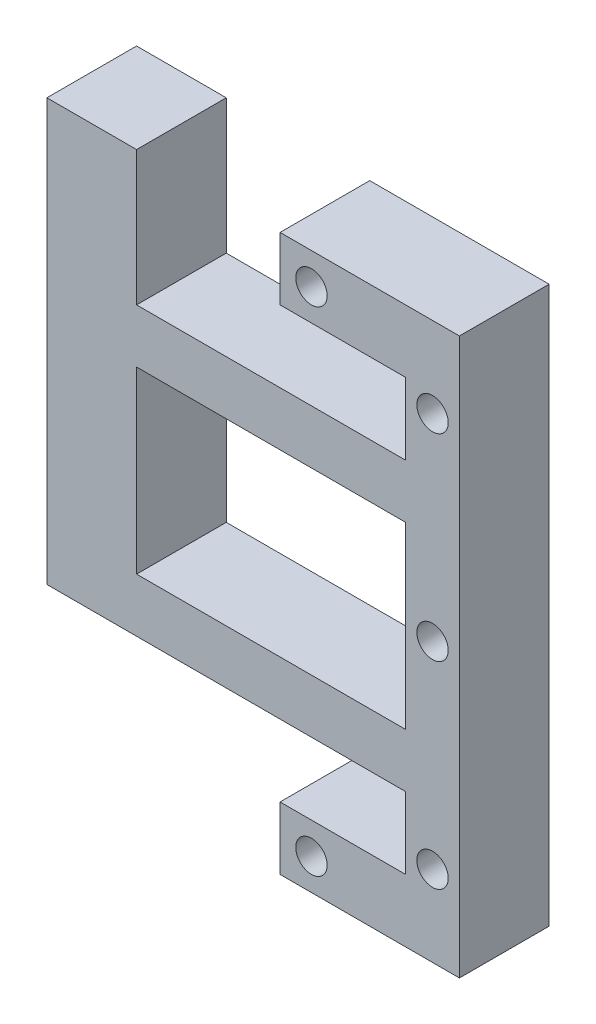
ISO-10303-21;
HEADER;
FILE_DESCRIPTION(('STEP AP214'),'2;1');
FILE_NAME('part.step','',(''),(''),'','','');
FILE_SCHEMA(('AUTOMOTIVE_DESIGN { 1 0 10303 214 1 1 1 1 }'));
ENDSEC;
DATA;
#1=APPLICATION_CONTEXT('core data for automotive mechanical design processes');
#2=APPLICATION_PROTOCOL_DEFINITION('international standard','automotive_design',2000,#1);
#3=PRODUCT_CONTEXT('',#1,'mechanical');
#4=PRODUCT('Part','Part','',(#3));
#5=PRODUCT_RELATED_PRODUCT_CATEGORY('part','',(#4));
#6=PRODUCT_DEFINITION_FORMATION('','',#4);
#7=PRODUCT_DEFINITION_CONTEXT('part definition',#1,'design');
#8=PRODUCT_DEFINITION('design','',#6,#7);
#9=PRODUCT_DEFINITION_SHAPE('','',#8);
#10=(LENGTH_UNIT() NAMED_UNIT(*) SI_UNIT(.MILLI.,.METRE.));
#11=(NAMED_UNIT(*) PLANE_ANGLE_UNIT() SI_UNIT($,.RADIAN.));
#12=(NAMED_UNIT(*) SI_UNIT($,.STERADIAN.) SOLID_ANGLE_UNIT());
#13=UNCERTAINTY_MEASURE_WITH_UNIT(LENGTH_MEASURE(1.E-05),#10,'distance_accuracy_value','');
#14=(GEOMETRIC_REPRESENTATION_CONTEXT(3) GLOBAL_UNCERTAINTY_ASSIGNED_CONTEXT((#13)) GLOBAL_UNIT_ASSIGNED_CONTEXT((#10,
#11,#12)) REPRESENTATION_CONTEXT('',''));
#15=CARTESIAN_POINT('',(0.,0.,0.));
#16=DIRECTION('',(0.,0.,1.));
#17=DIRECTION('',(1.,0.,0.));
#18=AXIS2_PLACEMENT_3D('',#15,#16,#17);
#19=CARTESIAN_POINT('',(5.,56.,10.));
#20=DIRECTION('',(1.,0.,0.));
#21=DIRECTION('',(0.,1.,0.));
#22=AXIS2_PLACEMENT_3D('',#19,#20,#21);
#23=PLANE('',#22);
#24=DIRECTION('',(0.,0.,1.));
#25=VECTOR('',#24,1.);
#26=CARTESIAN_POINT('',(5.,16.,-48.0520551069359));
#27=LINE('',#26,#25);
#28=CARTESIAN_POINT('',(5.,16.,0.));
#29=VERTEX_POINT('',#28);
#30=CARTESIAN_POINT('',(5.,16.,10.));
#31=VERTEX_POINT('',#30);
#32=EDGE_CURVE('E217',#29,#31,#27,.T.);
#33=ORIENTED_EDGE('',*,*,#32,.F.);
#34=DIRECTION('',(0.,-1.,0.));
#35=VECTOR('',#34,1.);
#36=CARTESIAN_POINT('',(5.,56.,0.));
#37=LINE('',#36,#35);
#38=CARTESIAN_POINT('',(5.,8.,0.));
#39=VERTEX_POINT('',#38);
#40=EDGE_CURVE('E230',#29,#39,#37,.T.);
#41=ORIENTED_EDGE('',*,*,#40,.T.);
#42=DIRECTION('',(0.,0.,-1.));
#43=VECTOR('',#42,1.);
#44=CARTESIAN_POINT('',(5.,8.,10.));
#45=LINE('',#44,#43);
#46=CARTESIAN_POINT('',(5.,8.,10.));
#47=VERTEX_POINT('',#46);
#48=EDGE_CURVE('E98',#47,#39,#45,.T.);
#49=ORIENTED_EDGE('',*,*,#48,.F.);
#50=DIRECTION('',(0.,-1.,0.));
#51=VECTOR('',#50,1.);
#52=CARTESIAN_POINT('',(5.,56.,10.));
#53=LINE('',#52,#51);
#54=EDGE_CURVE('E232',#31,#47,#53,.T.);
#55=ORIENTED_EDGE('',*,*,#54,.F.);
#56=EDGE_LOOP('',(#33,#41,#49,#55));
#57=FACE_BOUND('',#56,.T.);
#58=ADVANCED_FACE('F89',(#57),#23,.F.);
#59=CARTESIAN_POINT('',(5.,42.,0.));
#60=VERTEX_POINT('',#59);
#61=CARTESIAN_POINT('',(5.,22.,0.));
#62=VERTEX_POINT('',#61);
#63=EDGE_CURVE('E242',#60,#62,#37,.T.);
#64=ORIENTED_EDGE('',*,*,#63,.T.);
#65=DIRECTION('',(0.,0.,1.));
#66=VECTOR('',#65,1.);
#67=CARTESIAN_POINT('',(5.,22.,-48.0520551069359));
#68=LINE('',#67,#66);
#69=CARTESIAN_POINT('',(5.,22.,10.));
#70=VERTEX_POINT('',#69);
#71=EDGE_CURVE('E234',#62,#70,#68,.T.);
#72=ORIENTED_EDGE('',*,*,#71,.T.);
#73=CARTESIAN_POINT('',(5.,42.,10.));
#74=VERTEX_POINT('',#73);
#75=EDGE_CURVE('E313',#74,#70,#53,.T.);
#76=ORIENTED_EDGE('',*,*,#75,.F.);
#77=DIRECTION('',(0.,0.,1.));
#78=VECTOR('',#77,1.);
#79=CARTESIAN_POINT('',(5.,42.,-48.0520551069359));
#80=LINE('',#79,#78);
#81=EDGE_CURVE('E390',#60,#74,#80,.T.);
#82=ORIENTED_EDGE('',*,*,#81,.F.);
#83=EDGE_LOOP('',(#64,#72,#76,#82));
#84=FACE_BOUND('',#83,.T.);
#85=ADVANCED_FACE('F464',(#84),#23,.F.);
#86=CARTESIAN_POINT('',(0.,0.,10.));
#87=DIRECTION('',(0.,0.,-1.));
#88=DIRECTION('',(-1.,0.,0.));
#89=AXIS2_PLACEMENT_3D('',#86,#87,#88);
#90=PLANE('',#89);
#91=DIRECTION('',(-1.,0.,0.));
#92=VECTOR('',#91,1.);
#93=CARTESIAN_POINT('',(5.,42.,10.));
#94=LINE('',#93,#92);
#95=CARTESIAN_POINT('',(-25.,42.,10.));
#96=VERTEX_POINT('',#95);
#97=EDGE_CURVE('E394',#74,#96,#94,.T.);
#98=ORIENTED_EDGE('',*,*,#97,.F.);
#99=ORIENTED_EDGE('',*,*,#75,.T.);
#100=DIRECTION('',(-1.,0.,0.));
#101=VECTOR('',#100,1.);
#102=CARTESIAN_POINT('',(0.,22.,10.));
#103=LINE('',#102,#101);
#104=CARTESIAN_POINT('',(-25.,22.,10.));
#105=VERTEX_POINT('',#104);
#106=EDGE_CURVE('E226',#70,#105,#103,.T.);
#107=ORIENTED_EDGE('',*,*,#106,.T.);
#108=DIRECTION('',(0.,1.,0.));
#109=VECTOR('',#108,1.);
#110=CARTESIAN_POINT('',(-25.,16.,10.));
#111=LINE('',#110,#109);
#112=EDGE_CURVE('E428',#105,#96,#111,.T.);
#113=ORIENTED_EDGE('',*,*,#112,.T.);
#114=EDGE_LOOP('',(#98,#99,#107,#113));
#115=FACE_BOUND('',#114,.T.);
#116=DIRECTION('',(1.,0.,0.));
#117=VECTOR('',#116,1.);
#118=CARTESIAN_POINT('',(-9.,56.,10.));
#119=LINE('',#118,#117);
#120=CARTESIAN_POINT('',(-9.,56.,10.));
#121=VERTEX_POINT('',#120);
#122=CARTESIAN_POINT('',(5.,56.,10.));
#123=VERTEX_POINT('',#122);
#124=EDGE_CURVE('E276',#121,#123,#119,.T.);
#125=ORIENTED_EDGE('',*,*,#124,.T.);
#126=CARTESIAN_POINT('',(5.,48.,10.));
#127=VERTEX_POINT('',#126);
#128=EDGE_CURVE('E307',#123,#127,#53,.T.);
#129=ORIENTED_EDGE('',*,*,#128,.T.);
#130=DIRECTION('',(-1.,0.,0.));
#131=VECTOR('',#130,1.);
#132=CARTESIAN_POINT('',(5.,48.,10.));
#133=LINE('',#132,#131);
#134=CARTESIAN_POINT('',(-25.,48.,10.));
#135=VERTEX_POINT('',#134);
#136=EDGE_CURVE('E397',#127,#135,#133,.T.);
#137=ORIENTED_EDGE('',*,*,#136,.T.);
#138=CARTESIAN_POINT('',(-25.,63.,10.));
#139=VERTEX_POINT('',#138);
#140=EDGE_CURVE('E440',#135,#139,#111,.T.);
#141=ORIENTED_EDGE('',*,*,#140,.T.);
#142=DIRECTION('',(1.,0.,0.));
#143=VECTOR('',#142,1.);
#144=CARTESIAN_POINT('',(-35.,63.,10.));
#145=LINE('',#144,#143);
#146=CARTESIAN_POINT('',(-35.,63.,10.));
#147=VERTEX_POINT('',#146);
#148=EDGE_CURVE('E416',#147,#139,#145,.T.);
#149=ORIENTED_EDGE('',*,*,#148,.F.);
#150=DIRECTION('',(0.,1.,0.));
#151=VECTOR('',#150,1.);
#152=CARTESIAN_POINT('',(-35.,16.,10.));
#153=LINE('',#152,#151);
#154=CARTESIAN_POINT('',(-35.,16.,10.));
#155=VERTEX_POINT('',#154);
#156=EDGE_CURVE('E419',#155,#147,#153,.T.);
#157=ORIENTED_EDGE('',*,*,#156,.F.);
#158=DIRECTION('',(-1.,0.,0.));
#159=VECTOR('',#158,1.);
#160=CARTESIAN_POINT('',(0.,16.,10.));
#161=LINE('',#160,#159);
#162=EDGE_CURVE('E105',#31,#155,#161,.T.);
#163=ORIENTED_EDGE('',*,*,#162,.F.);
#164=ORIENTED_EDGE('',*,*,#54,.T.);
#165=DIRECTION('',(-1.,0.,0.));
#166=VECTOR('',#165,1.);
#167=CARTESIAN_POINT('',(5.,8.,10.));
#168=LINE('',#167,#166);
#169=CARTESIAN_POINT('',(-8.99999999999999,8.,10.));
#170=VERTEX_POINT('',#169);
#171=EDGE_CURVE('E303',#47,#170,#168,.T.);
#172=ORIENTED_EDGE('',*,*,#171,.T.);
#173=DIRECTION('',(0.,-1.,0.));
#174=VECTOR('',#173,1.);
#175=CARTESIAN_POINT('',(-8.99999999999999,8.,10.));
#176=LINE('',#175,#174);
#177=CARTESIAN_POINT('',(-8.99999999999999,1.00000000000001,10.));
#178=VERTEX_POINT('',#177);
#179=EDGE_CURVE('E306',#170,#178,#176,.T.);
#180=ORIENTED_EDGE('',*,*,#179,.T.);
#181=DIRECTION('',(1.,0.,0.));
#182=VECTOR('',#181,1.);
#183=CARTESIAN_POINT('',(-8.99999999999999,1.00000000000001,10.));
#184=LINE('',#183,#182);
#185=CARTESIAN_POINT('',(11.,1.00000000000001,10.));
#186=VERTEX_POINT('',#185);
#187=EDGE_CURVE('E311',#178,#186,#184,.T.);
#188=ORIENTED_EDGE('',*,*,#187,.T.);
#189=DIRECTION('',(0.,1.,0.));
#190=VECTOR('',#189,1.);
#191=CARTESIAN_POINT('',(11.,1.00000000000001,10.));
#192=LINE('',#191,#190);
#193=CARTESIAN_POINT('',(11.,63.,10.));
#194=VERTEX_POINT('',#193);
#195=EDGE_CURVE('E319',#186,#194,#192,.T.);
#196=ORIENTED_EDGE('',*,*,#195,.T.);
#197=DIRECTION('',(-1.,0.,0.));
#198=VECTOR('',#197,1.);
#199=CARTESIAN_POINT('',(11.,63.,10.));
#200=LINE('',#199,#198);
#201=CARTESIAN_POINT('',(-9.,63.,10.));
#202=VERTEX_POINT('',#201);
#203=EDGE_CURVE('E322',#194,#202,#200,.T.);
#204=ORIENTED_EDGE('',*,*,#203,.T.);
#205=DIRECTION('',(0.,-1.,0.));
#206=VECTOR('',#205,1.);
#207=CARTESIAN_POINT('',(-9.,63.,10.));
#208=LINE('',#207,#206);
#209=EDGE_CURVE('E282',#202,#121,#208,.T.);
#210=ORIENTED_EDGE('',*,*,#209,.T.);
#211=EDGE_LOOP('',(#125,#129,#137,#141,#149,#157,#163,#164,#172,#180,#188,#196,#204,#210));
#212=FACE_BOUND('',#211,.T.);
#213=CARTESIAN_POINT('',(-5.5,59.5,10.));
#214=DIRECTION('',(0.,0.,1.));
#215=DIRECTION('',(1.,0.,0.));
#216=AXIS2_PLACEMENT_3D('',#213,#214,#215);
#217=CIRCLE('',#216,1.75);
#218=CARTESIAN_POINT('',(-3.75,59.5,10.));
#219=VERTEX_POINT('',#218);
#220=EDGE_CURVE('E250',#219,#219,#217,.T.);
#221=ORIENTED_EDGE('',*,*,#220,.F.);
#222=EDGE_LOOP('',(#221));
#223=FACE_BOUND('',#222,.T.);
#224=CARTESIAN_POINT('',(8.,54.,10.));
#225=DIRECTION('',(0.,0.,1.));
#226=DIRECTION('',(1.,0.,0.));
#227=AXIS2_PLACEMENT_3D('',#224,#225,#226);
#228=CIRCLE('',#227,1.75);
#229=CARTESIAN_POINT('',(9.75,54.,10.));
#230=VERTEX_POINT('',#229);
#231=EDGE_CURVE('E347',#230,#230,#228,.T.);
#232=ORIENTED_EDGE('',*,*,#231,.F.);
#233=EDGE_LOOP('',(#232));
#234=FACE_BOUND('',#233,.T.);
#235=CARTESIAN_POINT('',(-5.49999999999999,4.5,10.));
#236=DIRECTION('',(0.,0.,1.));
#237=DIRECTION('',(1.,0.,0.));
#238=AXIS2_PLACEMENT_3D('',#235,#236,#237);
#239=CIRCLE('',#238,1.75);
#240=CARTESIAN_POINT('',(-3.74999999999999,4.5,10.));
#241=VERTEX_POINT('',#240);
#242=EDGE_CURVE('E355',#241,#241,#239,.T.);
#243=ORIENTED_EDGE('',*,*,#242,.F.);
#244=EDGE_LOOP('',(#243));
#245=FACE_BOUND('',#244,.T.);
#246=CARTESIAN_POINT('',(8.,10.,10.));
#247=DIRECTION('',(0.,0.,1.));
#248=DIRECTION('',(1.,0.,0.));
#249=AXIS2_PLACEMENT_3D('',#246,#247,#248);
#250=CIRCLE('',#249,1.75);
#251=CARTESIAN_POINT('',(9.75,10.,10.));
#252=VERTEX_POINT('',#251);
#253=EDGE_CURVE('E363',#252,#252,#250,.T.);
#254=ORIENTED_EDGE('',*,*,#253,.F.);
#255=EDGE_LOOP('',(#254));
#256=FACE_BOUND('',#255,.T.);
#257=CARTESIAN_POINT('',(8.,32.,10.));
#258=DIRECTION('',(0.,0.,1.));
#259=DIRECTION('',(1.,0.,0.));
#260=AXIS2_PLACEMENT_3D('',#257,#258,#259);
#261=CIRCLE('',#260,1.75);
#262=CARTESIAN_POINT('',(9.75,32.,10.));
#263=VERTEX_POINT('',#262);
#264=EDGE_CURVE('E371',#263,#263,#261,.T.);
#265=ORIENTED_EDGE('',*,*,#264,.F.);
#266=EDGE_LOOP('',(#265));
#267=FACE_BOUND('',#266,.T.);
#268=ADVANCED_FACE('F329',(#115,#212,#223,#234,#245,#256,#267),#90,.F.);
#269=CARTESIAN_POINT('',(0.,0.,0.));
#270=DIRECTION('',(0.,0.,-1.));
#271=DIRECTION('',(-1.,0.,0.));
#272=AXIS2_PLACEMENT_3D('',#269,#270,#271);
#273=PLANE('',#272);
#274=ORIENTED_EDGE('',*,*,#40,.F.);
#275=DIRECTION('',(-1.,0.,0.));
#276=VECTOR('',#275,1.);
#277=CARTESIAN_POINT('',(0.,16.,0.));
#278=LINE('',#277,#276);
#279=CARTESIAN_POINT('',(-35.,16.,0.));
#280=VERTEX_POINT('',#279);
#281=EDGE_CURVE('E214',#29,#280,#278,.T.);
#282=ORIENTED_EDGE('',*,*,#281,.T.);
#283=DIRECTION('',(0.,1.,0.));
#284=VECTOR('',#283,1.);
#285=CARTESIAN_POINT('',(-35.,16.,0.));
#286=LINE('',#285,#284);
#287=CARTESIAN_POINT('',(-35.,63.,0.));
#288=VERTEX_POINT('',#287);
#289=EDGE_CURVE('E425',#280,#288,#286,.T.);
#290=ORIENTED_EDGE('',*,*,#289,.T.);
#291=DIRECTION('',(1.,0.,0.));
#292=VECTOR('',#291,1.);
#293=CARTESIAN_POINT('',(-35.,63.,0.));
#294=LINE('',#293,#292);
#295=CARTESIAN_POINT('',(-25.,63.,0.));
#296=VERTEX_POINT('',#295);
#297=EDGE_CURVE('E389',#288,#296,#294,.T.);
#298=ORIENTED_EDGE('',*,*,#297,.T.);
#299=DIRECTION('',(0.,1.,0.));
#300=VECTOR('',#299,1.);
#301=CARTESIAN_POINT('',(-25.,16.,0.));
#302=LINE('',#301,#300);
#303=CARTESIAN_POINT('',(-25.,48.,0.));
#304=VERTEX_POINT('',#303);
#305=EDGE_CURVE('E434',#304,#296,#302,.T.);
#306=ORIENTED_EDGE('',*,*,#305,.F.);
#307=DIRECTION('',(-1.,0.,0.));
#308=VECTOR('',#307,1.);
#309=CARTESIAN_POINT('',(5.,48.,0.));
#310=LINE('',#309,#308);
#311=CARTESIAN_POINT('',(5.,48.,0.));
#312=VERTEX_POINT('',#311);
#313=EDGE_CURVE('E398',#312,#304,#310,.T.);
#314=ORIENTED_EDGE('',*,*,#313,.F.);
#315=CARTESIAN_POINT('',(5.,56.,0.));
#316=VERTEX_POINT('',#315);
#317=EDGE_CURVE('E245',#316,#312,#37,.T.);
#318=ORIENTED_EDGE('',*,*,#317,.F.);
#319=DIRECTION('',(1.,0.,0.));
#320=VECTOR('',#319,1.);
#321=CARTESIAN_POINT('',(-9.,56.,0.));
#322=LINE('',#321,#320);
#323=CARTESIAN_POINT('',(-9.,56.,0.));
#324=VERTEX_POINT('',#323);
#325=EDGE_CURVE('E243',#324,#316,#322,.T.);
#326=ORIENTED_EDGE('',*,*,#325,.F.);
#327=DIRECTION('',(0.,-1.,0.));
#328=VECTOR('',#327,1.);
#329=CARTESIAN_POINT('',(-9.,63.,0.));
#330=LINE('',#329,#328);
#331=CARTESIAN_POINT('',(-9.,63.,0.));
#332=VERTEX_POINT('',#331);
#333=EDGE_CURVE('E273',#332,#324,#330,.T.);
#334=ORIENTED_EDGE('',*,*,#333,.F.);
#335=DIRECTION('',(-1.,0.,0.));
#336=VECTOR('',#335,1.);
#337=CARTESIAN_POINT('',(11.,63.,0.));
#338=LINE('',#337,#336);
#339=CARTESIAN_POINT('',(11.,63.,0.));
#340=VERTEX_POINT('',#339);
#341=EDGE_CURVE('E270',#340,#332,#338,.T.);
#342=ORIENTED_EDGE('',*,*,#341,.F.);
#343=DIRECTION('',(0.,1.,0.));
#344=VECTOR('',#343,1.);
#345=CARTESIAN_POINT('',(11.,8.,0.));
#346=LINE('',#345,#344);
#347=CARTESIAN_POINT('',(11.,1.00000000000001,0.));
#348=VERTEX_POINT('',#347);
#349=EDGE_CURVE('E267',#348,#340,#346,.T.);
#350=ORIENTED_EDGE('',*,*,#349,.F.);
#351=DIRECTION('',(1.,0.,0.));
#352=VECTOR('',#351,1.);
#353=CARTESIAN_POINT('',(-2.41956087166107,1.00000000000001,0.));
#354=LINE('',#353,#352);
#355=CARTESIAN_POINT('',(-8.99999999999999,1.00000000000001,0.));
#356=VERTEX_POINT('',#355);
#357=EDGE_CURVE('E261',#356,#348,#354,.T.);
#358=ORIENTED_EDGE('',*,*,#357,.F.);
#359=DIRECTION('',(0.,-1.,0.));
#360=VECTOR('',#359,1.);
#361=CARTESIAN_POINT('',(-8.99999999999999,8.,0.));
#362=LINE('',#361,#360);
#363=CARTESIAN_POINT('',(-8.99999999999999,8.,0.));
#364=VERTEX_POINT('',#363);
#365=EDGE_CURVE('E255',#364,#356,#362,.T.);
#366=ORIENTED_EDGE('',*,*,#365,.F.);
#367=DIRECTION('',(-1.,0.,0.));
#368=VECTOR('',#367,1.);
#369=CARTESIAN_POINT('',(5.,8.,0.));
#370=LINE('',#369,#368);
#371=EDGE_CURVE('E240',#39,#364,#370,.T.);
#372=ORIENTED_EDGE('',*,*,#371,.F.);
#373=EDGE_LOOP('',(#274,#282,#290,#298,#306,#314,#318,#326,#334,#342,#350,#358,#366,#372));
#374=FACE_BOUND('',#373,.T.);
#375=CARTESIAN_POINT('',(8.,10.,0.));
#376=DIRECTION('',(0.,0.,1.));
#377=DIRECTION('',(1.,0.,0.));
#378=AXIS2_PLACEMENT_3D('',#375,#376,#377);
#379=CIRCLE('',#378,1.75);
#380=CARTESIAN_POINT('',(9.75,10.,0.));
#381=VERTEX_POINT('',#380);
#382=EDGE_CURVE('E367',#381,#381,#379,.T.);
#383=ORIENTED_EDGE('',*,*,#382,.T.);
#384=EDGE_LOOP('',(#383));
#385=FACE_BOUND('',#384,.T.);
#386=CARTESIAN_POINT('',(8.,54.,0.));
#387=DIRECTION('',(0.,0.,1.));
#388=DIRECTION('',(1.,0.,0.));
#389=AXIS2_PLACEMENT_3D('',#386,#387,#388);
#390=CIRCLE('',#389,1.75);
#391=CARTESIAN_POINT('',(9.75,54.,0.));
#392=VERTEX_POINT('',#391);
#393=EDGE_CURVE('E351',#392,#392,#390,.T.);
#394=ORIENTED_EDGE('',*,*,#393,.T.);
#395=EDGE_LOOP('',(#394));
#396=FACE_BOUND('',#395,.T.);
#397=DIRECTION('',(-1.,0.,0.));
#398=VECTOR('',#397,1.);
#399=CARTESIAN_POINT('',(0.,22.,0.));
#400=LINE('',#399,#398);
#401=CARTESIAN_POINT('',(-25.,22.,0.));
#402=VERTEX_POINT('',#401);
#403=EDGE_CURVE('E385',#62,#402,#400,.T.);
#404=ORIENTED_EDGE('',*,*,#403,.F.);
#405=ORIENTED_EDGE('',*,*,#63,.F.);
#406=DIRECTION('',(-1.,0.,0.));
#407=VECTOR('',#406,1.);
#408=CARTESIAN_POINT('',(5.,42.,0.));
#409=LINE('',#408,#407);
#410=CARTESIAN_POINT('',(-25.,42.,0.));
#411=VERTEX_POINT('',#410);
#412=EDGE_CURVE('E399',#60,#411,#409,.T.);
#413=ORIENTED_EDGE('',*,*,#412,.T.);
#414=EDGE_CURVE('E424',#402,#411,#302,.T.);
#415=ORIENTED_EDGE('',*,*,#414,.F.);
#416=EDGE_LOOP('',(#404,#405,#413,#415));
#417=FACE_BOUND('',#416,.T.);
#418=CARTESIAN_POINT('',(-5.5,59.5,0.));
#419=DIRECTION('',(0.,0.,1.));
#420=DIRECTION('',(1.,0.,0.));
#421=AXIS2_PLACEMENT_3D('',#418,#419,#420);
#422=CIRCLE('',#421,1.75);
#423=CARTESIAN_POINT('',(-3.75,59.5,0.));
#424=VERTEX_POINT('',#423);
#425=EDGE_CURVE('E343',#424,#424,#422,.T.);
#426=ORIENTED_EDGE('',*,*,#425,.T.);
#427=EDGE_LOOP('',(#426));
#428=FACE_BOUND('',#427,.T.);
#429=CARTESIAN_POINT('',(-5.49999999999999,4.5,0.));
#430=DIRECTION('',(0.,0.,1.));
#431=DIRECTION('',(1.,0.,0.));
#432=AXIS2_PLACEMENT_3D('',#429,#430,#431);
#433=CIRCLE('',#432,1.75);
#434=CARTESIAN_POINT('',(-3.74999999999999,4.5,0.));
#435=VERTEX_POINT('',#434);
#436=EDGE_CURVE('E359',#435,#435,#433,.T.);
#437=ORIENTED_EDGE('',*,*,#436,.T.);
#438=EDGE_LOOP('',(#437));
#439=FACE_BOUND('',#438,.T.);
#440=CARTESIAN_POINT('',(8.,32.,0.));
#441=DIRECTION('',(0.,0.,1.));
#442=DIRECTION('',(1.,0.,0.));
#443=AXIS2_PLACEMENT_3D('',#440,#441,#442);
#444=CIRCLE('',#443,1.75);
#445=CARTESIAN_POINT('',(9.75,32.,0.));
#446=VERTEX_POINT('',#445);
#447=EDGE_CURVE('E225',#446,#446,#444,.T.);
#448=ORIENTED_EDGE('',*,*,#447,.T.);
#449=EDGE_LOOP('',(#448));
#450=FACE_BOUND('',#449,.T.);
#451=ADVANCED_FACE('F237',(#374,#385,#396,#417,#428,#439,#450),#273,.T.);
#452=CARTESIAN_POINT('',(-9.,56.,10.));
#453=DIRECTION('',(0.,1.,0.));
#454=DIRECTION('',(0.,0.,1.));
#455=AXIS2_PLACEMENT_3D('',#452,#453,#454);
#456=PLANE('',#455);
#457=ORIENTED_EDGE('',*,*,#325,.T.);
#458=DIRECTION('',(0.,0.,-1.));
#459=VECTOR('',#458,1.);
#460=CARTESIAN_POINT('',(5.,56.,10.));
#461=LINE('',#460,#459);
#462=EDGE_CURVE('E12',#123,#316,#461,.T.);
#463=ORIENTED_EDGE('',*,*,#462,.F.);
#464=ORIENTED_EDGE('',*,*,#124,.F.);
#465=DIRECTION('',(0.,0.,-1.));
#466=VECTOR('',#465,1.);
#467=CARTESIAN_POINT('',(-9.,56.,10.));
#468=LINE('',#467,#466);
#469=EDGE_CURVE('E277',#121,#324,#468,.T.);
#470=ORIENTED_EDGE('',*,*,#469,.T.);
#471=EDGE_LOOP('',(#457,#463,#464,#470));
#472=FACE_BOUND('',#471,.T.);
#473=ADVANCED_FACE('F91',(#472),#456,.F.);
#474=ORIENTED_EDGE('',*,*,#317,.T.);
#475=DIRECTION('',(0.,0.,1.));
#476=VECTOR('',#475,1.);
#477=CARTESIAN_POINT('',(5.,48.,-48.0520551069359));
#478=LINE('',#477,#476);
#479=EDGE_CURVE('E113',#312,#127,#478,.T.);
#480=ORIENTED_EDGE('',*,*,#479,.T.);
#481=ORIENTED_EDGE('',*,*,#128,.F.);
#482=ORIENTED_EDGE('',*,*,#462,.T.);
#483=EDGE_LOOP('',(#474,#480,#481,#482));
#484=FACE_BOUND('',#483,.T.);
#485=ADVANCED_FACE('F495',(#484),#23,.F.);
#486=CARTESIAN_POINT('',(5.,8.,10.));
#487=DIRECTION('',(0.,-1.,0.));
#488=DIRECTION('',(0.,0.,-1.));
#489=AXIS2_PLACEMENT_3D('',#486,#487,#488);
#490=PLANE('',#489);
#491=ORIENTED_EDGE('',*,*,#371,.T.);
#492=DIRECTION('',(0.,0.,-1.));
#493=VECTOR('',#492,1.);
#494=CARTESIAN_POINT('',(-8.99999999999999,8.,10.));
#495=LINE('',#494,#493);
#496=EDGE_CURVE('E298',#170,#364,#495,.T.);
#497=ORIENTED_EDGE('',*,*,#496,.F.);
#498=ORIENTED_EDGE('',*,*,#171,.F.);
#499=ORIENTED_EDGE('',*,*,#48,.T.);
#500=EDGE_LOOP('',(#491,#497,#498,#499));
#501=FACE_BOUND('',#500,.T.);
#502=ADVANCED_FACE('F302',(#501),#490,.F.);
#503=CARTESIAN_POINT('',(-8.99999999999999,8.,10.));
#504=DIRECTION('',(1.,0.,0.));
#505=DIRECTION('',(0.,0.,-1.));
#506=AXIS2_PLACEMENT_3D('',#503,#504,#505);
#507=PLANE('',#506);
#508=ORIENTED_EDGE('',*,*,#365,.T.);
#509=DIRECTION('',(0.,0.,-1.));
#510=VECTOR('',#509,1.);
#511=CARTESIAN_POINT('',(-8.99999999999999,1.00000000000001,10.));
#512=LINE('',#511,#510);
#513=EDGE_CURVE('E294',#178,#356,#512,.T.);
#514=ORIENTED_EDGE('',*,*,#513,.F.);
#515=ORIENTED_EDGE('',*,*,#179,.F.);
#516=ORIENTED_EDGE('',*,*,#496,.T.);
#517=EDGE_LOOP('',(#508,#514,#515,#516));
#518=FACE_BOUND('',#517,.T.);
#519=ADVANCED_FACE('F507',(#518),#507,.F.);
#520=CARTESIAN_POINT('',(-2.41956087166107,1.00000000000001,10.));
#521=DIRECTION('',(0.,1.,0.));
#522=DIRECTION('',(0.,0.,1.));
#523=AXIS2_PLACEMENT_3D('',#520,#521,#522);
#524=PLANE('',#523);
#525=ORIENTED_EDGE('',*,*,#357,.T.);
#526=DIRECTION('',(0.,0.,-1.));
#527=VECTOR('',#526,1.);
#528=CARTESIAN_POINT('',(11.,1.00000000000001,10.));
#529=LINE('',#528,#527);
#530=EDGE_CURVE('E290',#186,#348,#529,.T.);
#531=ORIENTED_EDGE('',*,*,#530,.F.);
#532=ORIENTED_EDGE('',*,*,#187,.F.);
#533=ORIENTED_EDGE('',*,*,#513,.T.);
#534=EDGE_LOOP('',(#525,#531,#532,#533));
#535=FACE_BOUND('',#534,.T.);
#536=ADVANCED_FACE('F529',(#535),#524,.F.);
#537=CARTESIAN_POINT('',(11.,8.,10.));
#538=DIRECTION('',(-1.,0.,0.));
#539=DIRECTION('',(0.,-1.,0.));
#540=AXIS2_PLACEMENT_3D('',#537,#538,#539);
#541=PLANE('',#540);
#542=ORIENTED_EDGE('',*,*,#349,.T.);
#543=DIRECTION('',(0.,0.,-1.));
#544=VECTOR('',#543,1.);
#545=CARTESIAN_POINT('',(11.,63.,10.));
#546=LINE('',#545,#544);
#547=EDGE_CURVE('E286',#194,#340,#546,.T.);
#548=ORIENTED_EDGE('',*,*,#547,.F.);
#549=ORIENTED_EDGE('',*,*,#195,.F.);
#550=ORIENTED_EDGE('',*,*,#530,.T.);
#551=EDGE_LOOP('',(#542,#548,#549,#550));
#552=FACE_BOUND('',#551,.T.);
#553=ADVANCED_FACE('F525',(#552),#541,.F.);
#554=CARTESIAN_POINT('',(11.,63.,10.));
#555=DIRECTION('',(0.,-1.,0.));
#556=DIRECTION('',(0.,0.,-1.));
#557=AXIS2_PLACEMENT_3D('',#554,#555,#556);
#558=PLANE('',#557);
#559=ORIENTED_EDGE('',*,*,#341,.T.);
#560=DIRECTION('',(0.,0.,-1.));
#561=VECTOR('',#560,1.);
#562=CARTESIAN_POINT('',(-9.,63.,10.));
#563=LINE('',#562,#561);
#564=EDGE_CURVE('E281',#202,#332,#563,.T.);
#565=ORIENTED_EDGE('',*,*,#564,.F.);
#566=ORIENTED_EDGE('',*,*,#203,.F.);
#567=ORIENTED_EDGE('',*,*,#547,.T.);
#568=EDGE_LOOP('',(#559,#565,#566,#567));
#569=FACE_BOUND('',#568,.T.);
#570=ADVANCED_FACE('F522',(#569),#558,.F.);
#571=CARTESIAN_POINT('',(-9.,63.,10.));
#572=DIRECTION('',(1.,0.,0.));
#573=DIRECTION('',(0.,0.,-1.));
#574=AXIS2_PLACEMENT_3D('',#571,#572,#573);
#575=PLANE('',#574);
#576=ORIENTED_EDGE('',*,*,#333,.T.);
#577=ORIENTED_EDGE('',*,*,#469,.F.);
#578=ORIENTED_EDGE('',*,*,#209,.F.);
#579=ORIENTED_EDGE('',*,*,#564,.T.);
#580=EDGE_LOOP('',(#576,#577,#578,#579));
#581=FACE_BOUND('',#580,.T.);
#582=ADVANCED_FACE('F336',(#581),#575,.F.);
#583=CARTESIAN_POINT('',(-5.5,59.5,10.));
#584=DIRECTION('',(0.,0.,-1.));
#585=DIRECTION('',(-1.,0.,0.));
#586=AXIS2_PLACEMENT_3D('',#583,#584,#585);
#587=CYLINDRICAL_SURFACE('',#586,1.75);
#588=ORIENTED_EDGE('',*,*,#220,.T.);
#589=EDGE_LOOP('',(#588));
#590=FACE_BOUND('',#589,.T.);
#591=ORIENTED_EDGE('',*,*,#425,.F.);
#592=EDGE_LOOP('',(#591));
#593=FACE_BOUND('',#592,.T.);
#594=ADVANCED_FACE('F521',(#590,#593),#587,.F.);
#595=CARTESIAN_POINT('',(8.,54.,10.));
#596=DIRECTION('',(0.,0.,-1.));
#597=DIRECTION('',(-1.,0.,0.));
#598=AXIS2_PLACEMENT_3D('',#595,#596,#597);
#599=CYLINDRICAL_SURFACE('',#598,1.75);
#600=ORIENTED_EDGE('',*,*,#231,.T.);
#601=EDGE_LOOP('',(#600));
#602=FACE_BOUND('',#601,.T.);
#603=ORIENTED_EDGE('',*,*,#393,.F.);
#604=EDGE_LOOP('',(#603));
#605=FACE_BOUND('',#604,.T.);
#606=ADVANCED_FACE('F570',(#602,#605),#599,.F.);
#607=CARTESIAN_POINT('',(-5.49999999999999,4.5,10.));
#608=DIRECTION('',(0.,0.,-1.));
#609=DIRECTION('',(-1.,0.,0.));
#610=AXIS2_PLACEMENT_3D('',#607,#608,#609);
#611=CYLINDRICAL_SURFACE('',#610,1.75);
#612=ORIENTED_EDGE('',*,*,#242,.T.);
#613=EDGE_LOOP('',(#612));
#614=FACE_BOUND('',#613,.T.);
#615=ORIENTED_EDGE('',*,*,#436,.F.);
#616=EDGE_LOOP('',(#615));
#617=FACE_BOUND('',#616,.T.);
#618=ADVANCED_FACE('F566',(#614,#617),#611,.F.);
#619=CARTESIAN_POINT('',(8.,10.,10.));
#620=DIRECTION('',(0.,0.,-1.));
#621=DIRECTION('',(-1.,0.,0.));
#622=AXIS2_PLACEMENT_3D('',#619,#620,#621);
#623=CYLINDRICAL_SURFACE('',#622,1.75);
#624=ORIENTED_EDGE('',*,*,#253,.T.);
#625=EDGE_LOOP('',(#624));
#626=FACE_BOUND('',#625,.T.);
#627=ORIENTED_EDGE('',*,*,#382,.F.);
#628=EDGE_LOOP('',(#627));
#629=FACE_BOUND('',#628,.T.);
#630=ADVANCED_FACE('F562',(#626,#629),#623,.F.);
#631=CARTESIAN_POINT('',(8.,32.,10.));
#632=DIRECTION('',(0.,0.,-1.));
#633=DIRECTION('',(-1.,0.,0.));
#634=AXIS2_PLACEMENT_3D('',#631,#632,#633);
#635=CYLINDRICAL_SURFACE('',#634,1.75);
#636=ORIENTED_EDGE('',*,*,#264,.T.);
#637=EDGE_LOOP('',(#636));
#638=FACE_BOUND('',#637,.T.);
#639=ORIENTED_EDGE('',*,*,#447,.F.);
#640=EDGE_LOOP('',(#639));
#641=FACE_BOUND('',#640,.T.);
#642=ADVANCED_FACE('F559',(#638,#641),#635,.F.);
#643=CARTESIAN_POINT('',(0.,22.,-48.0520551069359));
#644=DIRECTION('',(0.,1.,0.));
#645=DIRECTION('',(-1.,0.,0.));
#646=AXIS2_PLACEMENT_3D('',#643,#644,#645);
#647=PLANE('',#646);
#648=ORIENTED_EDGE('',*,*,#71,.F.);
#649=ORIENTED_EDGE('',*,*,#403,.T.);
#650=DIRECTION('',(0.,0.,1.));
#651=VECTOR('',#650,1.);
#652=CARTESIAN_POINT('',(-25.,22.,-48.0520551069359));
#653=LINE('',#652,#651);
#654=EDGE_CURVE('E446',#402,#105,#653,.T.);
#655=ORIENTED_EDGE('',*,*,#654,.T.);
#656=ORIENTED_EDGE('',*,*,#106,.F.);
#657=EDGE_LOOP('',(#648,#649,#655,#656));
#658=FACE_BOUND('',#657,.T.);
#659=ADVANCED_FACE('F461',(#658),#647,.T.);
#660=CARTESIAN_POINT('',(0.,16.,-48.0520551069359));
#661=DIRECTION('',(0.,1.,0.));
#662=DIRECTION('',(-1.,0.,0.));
#663=AXIS2_PLACEMENT_3D('',#660,#661,#662);
#664=PLANE('',#663);
#665=ORIENTED_EDGE('',*,*,#281,.F.);
#666=ORIENTED_EDGE('',*,*,#32,.T.);
#667=ORIENTED_EDGE('',*,*,#162,.T.);
#668=DIRECTION('',(0.,0.,1.));
#669=VECTOR('',#668,1.);
#670=CARTESIAN_POINT('',(-35.,16.,-48.0520551069359));
#671=LINE('',#670,#669);
#672=EDGE_CURVE('E220',#280,#155,#671,.T.);
#673=ORIENTED_EDGE('',*,*,#672,.F.);
#674=EDGE_LOOP('',(#665,#666,#667,#673));
#675=FACE_BOUND('',#674,.T.);
#676=ADVANCED_FACE('F216',(#675),#664,.F.);
#677=CARTESIAN_POINT('',(5.,48.,-48.0520551069359));
#678=DIRECTION('',(0.,1.,0.));
#679=DIRECTION('',(-1.,0.,0.));
#680=AXIS2_PLACEMENT_3D('',#677,#678,#679);
#681=PLANE('',#680);
#682=ORIENTED_EDGE('',*,*,#313,.T.);
#683=DIRECTION('',(0.,0.,1.));
#684=VECTOR('',#683,1.);
#685=CARTESIAN_POINT('',(-25.,48.,-48.0520551069359));
#686=LINE('',#685,#684);
#687=EDGE_CURVE('E386',#304,#135,#686,.T.);
#688=ORIENTED_EDGE('',*,*,#687,.T.);
#689=ORIENTED_EDGE('',*,*,#136,.F.);
#690=ORIENTED_EDGE('',*,*,#479,.F.);
#691=EDGE_LOOP('',(#682,#688,#689,#690));
#692=FACE_BOUND('',#691,.T.);
#693=ADVANCED_FACE('F478',(#692),#681,.T.);
#694=CARTESIAN_POINT('',(-25.,16.,-48.0520551069359));
#695=DIRECTION('',(1.,0.,0.));
#696=DIRECTION('',(0.,0.,-1.));
#697=AXIS2_PLACEMENT_3D('',#694,#695,#696);
#698=PLANE('',#697);
#699=ORIENTED_EDGE('',*,*,#687,.F.);
#700=ORIENTED_EDGE('',*,*,#305,.T.);
#701=DIRECTION('',(0.,0.,1.));
#702=VECTOR('',#701,1.);
#703=CARTESIAN_POINT('',(-25.,63.,-48.0520551069359));
#704=LINE('',#703,#702);
#705=EDGE_CURVE('E420',#296,#139,#704,.T.);
#706=ORIENTED_EDGE('',*,*,#705,.T.);
#707=ORIENTED_EDGE('',*,*,#140,.F.);
#708=EDGE_LOOP('',(#699,#700,#706,#707));
#709=FACE_BOUND('',#708,.T.);
#710=ADVANCED_FACE('F477',(#709),#698,.T.);
#711=CARTESIAN_POINT('',(-35.,63.,-48.0520551069359));
#712=DIRECTION('',(0.,-1.,0.));
#713=DIRECTION('',(0.,0.,-1.));
#714=AXIS2_PLACEMENT_3D('',#711,#712,#713);
#715=PLANE('',#714);
#716=ORIENTED_EDGE('',*,*,#297,.F.);
#717=DIRECTION('',(0.,0.,1.));
#718=VECTOR('',#717,1.);
#719=CARTESIAN_POINT('',(-35.,63.,-48.0520551069359));
#720=LINE('',#719,#718);
#721=EDGE_CURVE('E403',#288,#147,#720,.T.);
#722=ORIENTED_EDGE('',*,*,#721,.T.);
#723=ORIENTED_EDGE('',*,*,#148,.T.);
#724=ORIENTED_EDGE('',*,*,#705,.F.);
#725=EDGE_LOOP('',(#716,#722,#723,#724));
#726=FACE_BOUND('',#725,.T.);
#727=ADVANCED_FACE('F487',(#726),#715,.F.);
#728=CARTESIAN_POINT('',(-35.,16.,-48.0520551069359));
#729=DIRECTION('',(1.,0.,0.));
#730=DIRECTION('',(0.,0.,-1.));
#731=AXIS2_PLACEMENT_3D('',#728,#729,#730);
#732=PLANE('',#731);
#733=ORIENTED_EDGE('',*,*,#721,.F.);
#734=ORIENTED_EDGE('',*,*,#289,.F.);
#735=ORIENTED_EDGE('',*,*,#672,.T.);
#736=ORIENTED_EDGE('',*,*,#156,.T.);
#737=EDGE_LOOP('',(#733,#734,#735,#736));
#738=FACE_BOUND('',#737,.T.);
#739=ADVANCED_FACE('F479',(#738),#732,.F.);
#740=CARTESIAN_POINT('',(5.,42.,-48.0520551069359));
#741=DIRECTION('',(0.,1.,0.));
#742=DIRECTION('',(-1.,0.,0.));
#743=AXIS2_PLACEMENT_3D('',#740,#741,#742);
#744=PLANE('',#743);
#745=DIRECTION('',(0.,0.,1.));
#746=VECTOR('',#745,1.);
#747=CARTESIAN_POINT('',(-25.,42.,-48.0520551069359));
#748=LINE('',#747,#746);
#749=EDGE_CURVE('E381',#411,#96,#748,.T.);
#750=ORIENTED_EDGE('',*,*,#749,.F.);
#751=ORIENTED_EDGE('',*,*,#412,.F.);
#752=ORIENTED_EDGE('',*,*,#81,.T.);
#753=ORIENTED_EDGE('',*,*,#97,.T.);
#754=EDGE_LOOP('',(#750,#751,#752,#753));
#755=FACE_BOUND('',#754,.T.);
#756=ADVANCED_FACE('F472',(#755),#744,.F.);
#757=ORIENTED_EDGE('',*,*,#112,.F.);
#758=ORIENTED_EDGE('',*,*,#654,.F.);
#759=ORIENTED_EDGE('',*,*,#414,.T.);
#760=ORIENTED_EDGE('',*,*,#749,.T.);
#761=EDGE_LOOP('',(#757,#758,#759,#760));
#762=FACE_BOUND('',#761,.T.);
#763=ADVANCED_FACE('F474',(#762),#698,.T.);
#764=CLOSED_SHELL('',(#58,#85,#268,#451,#473,#485,#502,#519,#536,#553,#570,#582,#594,#606,#618,
#630,#642,#659,#676,#693,#710,#727,#739,#756,#763));
#765=MANIFOLD_SOLID_BREP('B2',#764);
#766=ADVANCED_BREP_SHAPE_REPRESENTATION('',(#18,#765),#14);
#767=SHAPE_DEFINITION_REPRESENTATION(#9,#766);
ENDSEC;
END-ISO-10303-21;
